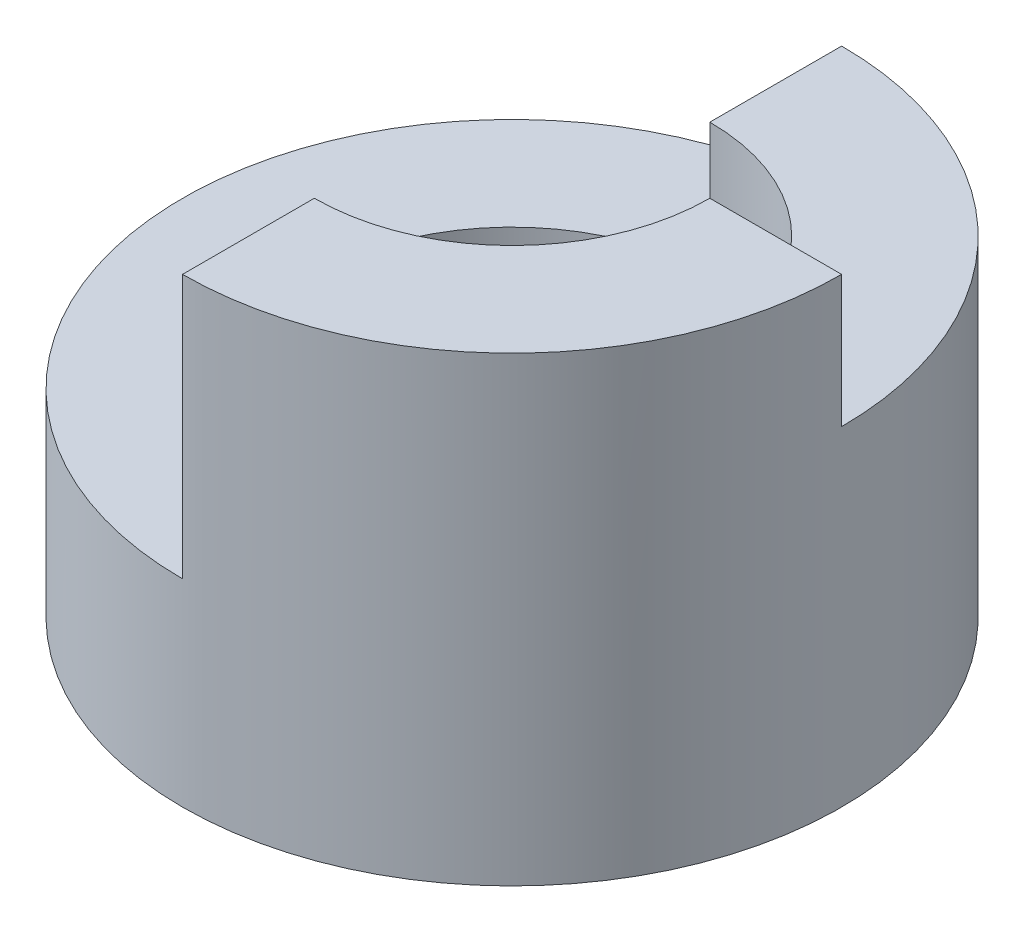
ISO-10303-21;
HEADER;
FILE_DESCRIPTION(('STEP AP214'),'2;1');
FILE_NAME('part.step','',(''),(''),'','','');
FILE_SCHEMA(('AUTOMOTIVE_DESIGN { 1 0 10303 214 1 1 1 1 }'));
ENDSEC;
DATA;
#1=APPLICATION_CONTEXT('core data for automotive mechanical design processes');
#2=APPLICATION_PROTOCOL_DEFINITION('international standard','automotive_design',2000,#1);
#3=PRODUCT_CONTEXT('',#1,'mechanical');
#4=PRODUCT('Part','Part','',(#3));
#5=PRODUCT_RELATED_PRODUCT_CATEGORY('part','',(#4));
#6=PRODUCT_DEFINITION_FORMATION('','',#4);
#7=PRODUCT_DEFINITION_CONTEXT('part definition',#1,'design');
#8=PRODUCT_DEFINITION('design','',#6,#7);
#9=PRODUCT_DEFINITION_SHAPE('','',#8);
#10=(LENGTH_UNIT() NAMED_UNIT(*) SI_UNIT(.MILLI.,.METRE.));
#11=(NAMED_UNIT(*) PLANE_ANGLE_UNIT() SI_UNIT($,.RADIAN.));
#12=(NAMED_UNIT(*) SI_UNIT($,.STERADIAN.) SOLID_ANGLE_UNIT());
#13=UNCERTAINTY_MEASURE_WITH_UNIT(LENGTH_MEASURE(1.E-05),#10,'distance_accuracy_value','');
#14=(GEOMETRIC_REPRESENTATION_CONTEXT(3) GLOBAL_UNCERTAINTY_ASSIGNED_CONTEXT((#13)) GLOBAL_UNIT_ASSIGNED_CONTEXT((#10,
#11,#12)) REPRESENTATION_CONTEXT('',''));
#15=CARTESIAN_POINT('',(0.,0.,0.));
#16=DIRECTION('',(0.,0.,1.));
#17=DIRECTION('',(1.,0.,0.));
#18=AXIS2_PLACEMENT_3D('',#15,#16,#17);
#19=CARTESIAN_POINT('',(0.,3.,-5.));
#20=DIRECTION('',(1.,0.,0.));
#21=DIRECTION('',(0.,0.,-1.));
#22=AXIS2_PLACEMENT_3D('',#19,#20,#21);
#23=PLANE('',#22);
#24=DIRECTION('',(0.,0.,1.));
#25=VECTOR('',#24,1.);
#26=CARTESIAN_POINT('',(0.,5.,-5.));
#27=LINE('',#26,#25);
#28=CARTESIAN_POINT('',(0.,5.,-5.));
#29=VERTEX_POINT('',#28);
#30=CARTESIAN_POINT('',(0.,5.,-3.));
#31=VERTEX_POINT('',#30);
#32=EDGE_CURVE('E91',#29,#31,#27,.T.);
#33=ORIENTED_EDGE('',*,*,#32,.F.);
#34=DIRECTION('',(0.,1.,0.));
#35=VECTOR('',#34,1.);
#36=CARTESIAN_POINT('',(0.,3.,-5.));
#37=LINE('',#36,#35);
#38=CARTESIAN_POINT('',(0.,3.,-5.));
#39=VERTEX_POINT('',#38);
#40=EDGE_CURVE('E105',#39,#29,#37,.T.);
#41=ORIENTED_EDGE('',*,*,#40,.F.);
#42=DIRECTION('',(0.,0.,-1.));
#43=VECTOR('',#42,1.);
#44=CARTESIAN_POINT('',(0.,3.,-5.));
#45=LINE('',#44,#43);
#46=CARTESIAN_POINT('',(0.,3.,-3.));
#47=VERTEX_POINT('',#46);
#48=EDGE_CURVE('E108',#47,#39,#45,.T.);
#49=ORIENTED_EDGE('',*,*,#48,.F.);
#50=DIRECTION('',(0.,-1.,0.));
#51=VECTOR('',#50,1.);
#52=CARTESIAN_POINT('',(0.,7.,-3.));
#53=LINE('',#52,#51);
#54=EDGE_CURVE('E132',#47,#31,#53,.F.);
#55=ORIENTED_EDGE('',*,*,#54,.T.);
#56=EDGE_LOOP('',(#33,#41,#49,#55));
#57=FACE_BOUND('',#56,.T.);
#58=ADVANCED_FACE('F33',(#57),#23,.F.);
#59=CARTESIAN_POINT('',(0.,7.,0.));
#60=DIRECTION('',(0.,1.,0.));
#61=DIRECTION('',(0.,0.,1.));
#62=AXIS2_PLACEMENT_3D('',#59,#60,#61);
#63=PLANE('',#62);
#64=DIRECTION('',(1.,0.,0.));
#65=VECTOR('',#64,1.);
#66=CARTESIAN_POINT('',(0.,7.,0.));
#67=LINE('',#66,#65);
#68=CARTESIAN_POINT('',(3.,7.,0.));
#69=VERTEX_POINT('',#68);
#70=CARTESIAN_POINT('',(5.,7.,0.));
#71=VERTEX_POINT('',#70);
#72=EDGE_CURVE('E96',#69,#71,#67,.T.);
#73=ORIENTED_EDGE('',*,*,#72,.F.);
#74=CARTESIAN_POINT('',(0.,7.,0.));
#75=DIRECTION('',(0.,1.,0.));
#76=DIRECTION('',(0.,0.,1.));
#77=AXIS2_PLACEMENT_3D('',#74,#75,#76);
#78=CIRCLE('',#77,3.);
#79=CARTESIAN_POINT('',(0.,7.,3.));
#80=VERTEX_POINT('',#79);
#81=EDGE_CURVE('E120',#80,#69,#78,.T.);
#82=ORIENTED_EDGE('',*,*,#81,.F.);
#83=DIRECTION('',(0.,0.,-1.));
#84=VECTOR('',#83,1.);
#85=CARTESIAN_POINT('',(0.,7.,-5.));
#86=LINE('',#85,#84);
#87=CARTESIAN_POINT('',(0.,7.,5.));
#88=VERTEX_POINT('',#87);
#89=EDGE_CURVE('E106',#88,#80,#86,.T.);
#90=ORIENTED_EDGE('',*,*,#89,.F.);
#91=CARTESIAN_POINT('',(0.,7.,0.));
#92=DIRECTION('',(0.,1.,0.));
#93=DIRECTION('',(0.,0.,1.));
#94=AXIS2_PLACEMENT_3D('',#91,#92,#93);
#95=CIRCLE('',#94,5.);
#96=EDGE_CURVE('E126',#88,#71,#95,.T.);
#97=ORIENTED_EDGE('',*,*,#96,.T.);
#98=EDGE_LOOP('',(#73,#82,#90,#97));
#99=FACE_BOUND('',#98,.T.);
#100=ADVANCED_FACE('F148',(#99),#63,.T.);
#101=CARTESIAN_POINT('',(0.,0.,0.));
#102=DIRECTION('',(0.,1.,0.));
#103=DIRECTION('',(0.,0.,1.));
#104=AXIS2_PLACEMENT_3D('',#101,#102,#103);
#105=PLANE('',#104);
#106=CARTESIAN_POINT('',(0.,0.,0.));
#107=DIRECTION('',(0.,1.,0.));
#108=DIRECTION('',(0.,0.,1.));
#109=AXIS2_PLACEMENT_3D('',#106,#107,#108);
#110=CIRCLE('',#109,5.);
#111=CARTESIAN_POINT('',(0.,0.,5.));
#112=VERTEX_POINT('',#111);
#113=EDGE_CURVE('E123',#112,#112,#110,.T.);
#114=ORIENTED_EDGE('',*,*,#113,.F.);
#115=EDGE_LOOP('',(#114));
#116=FACE_BOUND('',#115,.T.);
#117=CARTESIAN_POINT('',(0.,0.,0.));
#118=DIRECTION('',(0.,1.,0.));
#119=DIRECTION('',(0.,0.,1.));
#120=AXIS2_PLACEMENT_3D('',#117,#118,#119);
#121=CIRCLE('',#120,3.);
#122=CARTESIAN_POINT('',(0.,0.,3.));
#123=VERTEX_POINT('',#122);
#124=EDGE_CURVE('E119',#123,#123,#121,.T.);
#125=ORIENTED_EDGE('',*,*,#124,.T.);
#126=EDGE_LOOP('',(#125));
#127=FACE_BOUND('',#126,.T.);
#128=ADVANCED_FACE('F152',(#116,#127),#105,.F.);
#129=CARTESIAN_POINT('',(0.,7.,0.));
#130=DIRECTION('',(0.,-1.,0.));
#131=DIRECTION('',(0.,0.,-1.));
#132=AXIS2_PLACEMENT_3D('',#129,#130,#131);
#133=CYLINDRICAL_SURFACE('',#132,5.);
#134=CARTESIAN_POINT('',(0.,5.,0.));
#135=DIRECTION('',(0.,1.,0.));
#136=DIRECTION('',(0.,0.,1.));
#137=AXIS2_PLACEMENT_3D('',#134,#135,#136);
#138=CIRCLE('',#137,5.);
#139=CARTESIAN_POINT('',(5.,5.,0.));
#140=VERTEX_POINT('',#139);
#141=EDGE_CURVE('E48',#140,#29,#138,.T.);
#142=ORIENTED_EDGE('',*,*,#141,.F.);
#143=DIRECTION('',(0.,1.,0.));
#144=VECTOR('',#143,1.);
#145=CARTESIAN_POINT('',(5.,5.,0.));
#146=LINE('',#145,#144);
#147=EDGE_CURVE('E90',#140,#71,#146,.T.);
#148=ORIENTED_EDGE('',*,*,#147,.T.);
#149=ORIENTED_EDGE('',*,*,#96,.F.);
#150=DIRECTION('',(0.,-1.,0.));
#151=VECTOR('',#150,1.);
#152=CARTESIAN_POINT('',(0.,7.,5.));
#153=LINE('',#152,#151);
#154=CARTESIAN_POINT('',(0.,3.,5.));
#155=VERTEX_POINT('',#154);
#156=EDGE_CURVE('E116',#88,#155,#153,.T.);
#157=ORIENTED_EDGE('',*,*,#156,.T.);
#158=CARTESIAN_POINT('',(0.,3.,0.));
#159=DIRECTION('',(0.,-1.,0.));
#160=DIRECTION('',(0.,0.,-1.));
#161=AXIS2_PLACEMENT_3D('',#158,#159,#160);
#162=CIRCLE('',#161,5.);
#163=EDGE_CURVE('E114',#155,#39,#162,.T.);
#164=ORIENTED_EDGE('',*,*,#163,.T.);
#165=ORIENTED_EDGE('',*,*,#40,.T.);
#166=EDGE_LOOP('',(#142,#148,#149,#157,#164,#165));
#167=FACE_BOUND('',#166,.T.);
#168=ORIENTED_EDGE('',*,*,#113,.T.);
#169=EDGE_LOOP('',(#168));
#170=FACE_BOUND('',#169,.T.);
#171=ADVANCED_FACE('F35',(#167,#170),#133,.T.);
#172=CARTESIAN_POINT('',(0.,7.,0.));
#173=DIRECTION('',(0.,-1.,0.));
#174=DIRECTION('',(0.,0.,-1.));
#175=AXIS2_PLACEMENT_3D('',#172,#173,#174);
#176=CYLINDRICAL_SURFACE('',#175,3.);
#177=DIRECTION('',(0.,-1.,0.));
#178=VECTOR('',#177,1.);
#179=CARTESIAN_POINT('',(3.,7.,0.));
#180=LINE('',#179,#178);
#181=CARTESIAN_POINT('',(3.,5.,0.));
#182=VERTEX_POINT('',#181);
#183=EDGE_CURVE('E11',#182,#69,#180,.F.);
#184=ORIENTED_EDGE('',*,*,#183,.F.);
#185=CARTESIAN_POINT('',(0.,5.,0.));
#186=DIRECTION('',(0.,1.,0.));
#187=DIRECTION('',(0.,0.,1.));
#188=AXIS2_PLACEMENT_3D('',#185,#186,#187);
#189=CIRCLE('',#188,3.);
#190=EDGE_CURVE('E87',#182,#31,#189,.T.);
#191=ORIENTED_EDGE('',*,*,#190,.T.);
#192=ORIENTED_EDGE('',*,*,#54,.F.);
#193=CARTESIAN_POINT('',(0.,3.,0.));
#194=DIRECTION('',(0.,-1.,0.));
#195=DIRECTION('',(0.,0.,-1.));
#196=AXIS2_PLACEMENT_3D('',#193,#194,#195);
#197=CIRCLE('',#196,3.);
#198=CARTESIAN_POINT('',(0.,3.,3.));
#199=VERTEX_POINT('',#198);
#200=EDGE_CURVE('E128',#199,#47,#197,.T.);
#201=ORIENTED_EDGE('',*,*,#200,.F.);
#202=DIRECTION('',(0.,-1.,0.));
#203=VECTOR('',#202,1.);
#204=CARTESIAN_POINT('',(0.,7.,3.));
#205=LINE('',#204,#203);
#206=EDGE_CURVE('E41',#80,#199,#205,.T.);
#207=ORIENTED_EDGE('',*,*,#206,.F.);
#208=ORIENTED_EDGE('',*,*,#81,.T.);
#209=EDGE_LOOP('',(#184,#191,#192,#201,#207,#208));
#210=FACE_BOUND('',#209,.T.);
#211=ORIENTED_EDGE('',*,*,#124,.F.);
#212=EDGE_LOOP('',(#211));
#213=FACE_BOUND('',#212,.T.);
#214=ADVANCED_FACE('F142',(#210,#213),#176,.F.);
#215=ORIENTED_EDGE('',*,*,#89,.T.);
#216=ORIENTED_EDGE('',*,*,#206,.T.);
#217=EDGE_CURVE('E56',#155,#199,#45,.T.);
#218=ORIENTED_EDGE('',*,*,#217,.F.);
#219=ORIENTED_EDGE('',*,*,#156,.F.);
#220=EDGE_LOOP('',(#215,#216,#218,#219));
#221=FACE_BOUND('',#220,.T.);
#222=ADVANCED_FACE('F137',(#221),#23,.F.);
#223=CARTESIAN_POINT('',(0.,3.,0.));
#224=DIRECTION('',(0.,-1.,0.));
#225=DIRECTION('',(0.,0.,-1.));
#226=AXIS2_PLACEMENT_3D('',#223,#224,#225);
#227=PLANE('',#226);
#228=ORIENTED_EDGE('',*,*,#217,.T.);
#229=ORIENTED_EDGE('',*,*,#200,.T.);
#230=ORIENTED_EDGE('',*,*,#48,.T.);
#231=ORIENTED_EDGE('',*,*,#163,.F.);
#232=EDGE_LOOP('',(#228,#229,#230,#231));
#233=FACE_BOUND('',#232,.T.);
#234=ADVANCED_FACE('F145',(#233),#227,.F.);
#235=CARTESIAN_POINT('',(0.,5.,0.));
#236=DIRECTION('',(0.,1.,0.));
#237=DIRECTION('',(0.,0.,1.));
#238=AXIS2_PLACEMENT_3D('',#235,#236,#237);
#239=PLANE('',#238);
#240=ORIENTED_EDGE('',*,*,#141,.T.);
#241=ORIENTED_EDGE('',*,*,#32,.T.);
#242=ORIENTED_EDGE('',*,*,#190,.F.);
#243=DIRECTION('',(1.,0.,0.));
#244=VECTOR('',#243,1.);
#245=CARTESIAN_POINT('',(0.,5.,0.));
#246=LINE('',#245,#244);
#247=EDGE_CURVE('E83',#182,#140,#246,.T.);
#248=ORIENTED_EDGE('',*,*,#247,.T.);
#249=EDGE_LOOP('',(#240,#241,#242,#248));
#250=FACE_BOUND('',#249,.T.);
#251=ADVANCED_FACE('F85',(#250),#239,.T.);
#252=CARTESIAN_POINT('',(0.,5.,0.));
#253=DIRECTION('',(0.,0.,1.));
#254=DIRECTION('',(1.,0.,0.));
#255=AXIS2_PLACEMENT_3D('',#252,#253,#254);
#256=PLANE('',#255);
#257=ORIENTED_EDGE('',*,*,#183,.T.);
#258=ORIENTED_EDGE('',*,*,#72,.T.);
#259=ORIENTED_EDGE('',*,*,#147,.F.);
#260=ORIENTED_EDGE('',*,*,#247,.F.);
#261=EDGE_LOOP('',(#257,#258,#259,#260));
#262=FACE_BOUND('',#261,.T.);
#263=ADVANCED_FACE('F94',(#262),#256,.F.);
#264=CLOSED_SHELL('',(#58,#100,#128,#171,#214,#222,#234,#251,#263));
#265=MANIFOLD_SOLID_BREP('B2',#264);
#266=ADVANCED_BREP_SHAPE_REPRESENTATION('',(#18,#265),#14);
#267=SHAPE_DEFINITION_REPRESENTATION(#9,#266);
ENDSEC;
END-ISO-10303-21;
